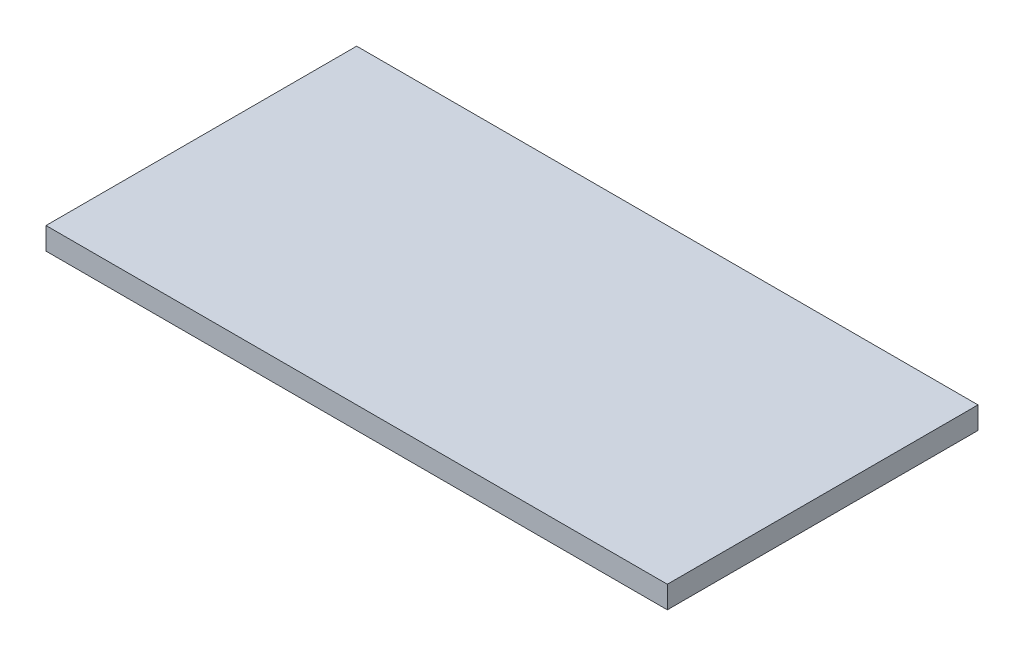
ISO-10303-21;
HEADER;
FILE_DESCRIPTION(('STEP AP214'),'2;1');
FILE_NAME('part.step','',(''),(''),'','','');
FILE_SCHEMA(('AUTOMOTIVE_DESIGN { 1 0 10303 214 1 1 1 1 }'));
ENDSEC;
DATA;
#1=APPLICATION_CONTEXT('core data for automotive mechanical design processes');
#2=APPLICATION_PROTOCOL_DEFINITION('international standard','automotive_design',2000,#1);
#3=PRODUCT_CONTEXT('',#1,'mechanical');
#4=PRODUCT('Part','Part','',(#3));
#5=PRODUCT_RELATED_PRODUCT_CATEGORY('part','',(#4));
#6=PRODUCT_DEFINITION_FORMATION('','',#4);
#7=PRODUCT_DEFINITION_CONTEXT('part definition',#1,'design');
#8=PRODUCT_DEFINITION('design','',#6,#7);
#9=PRODUCT_DEFINITION_SHAPE('','',#8);
#10=(LENGTH_UNIT() NAMED_UNIT(*) SI_UNIT(.MILLI.,.METRE.));
#11=(NAMED_UNIT(*) PLANE_ANGLE_UNIT() SI_UNIT($,.RADIAN.));
#12=(NAMED_UNIT(*) SI_UNIT($,.STERADIAN.) SOLID_ANGLE_UNIT());
#13=UNCERTAINTY_MEASURE_WITH_UNIT(LENGTH_MEASURE(1.E-05),#10,'distance_accuracy_value','');
#14=(GEOMETRIC_REPRESENTATION_CONTEXT(3) GLOBAL_UNCERTAINTY_ASSIGNED_CONTEXT((#13)) GLOBAL_UNIT_ASSIGNED_CONTEXT((#10,
#11,#12)) REPRESENTATION_CONTEXT('',''));
#15=CARTESIAN_POINT('',(0.,0.,0.));
#16=DIRECTION('',(0.,0.,1.));
#17=DIRECTION('',(1.,0.,0.));
#18=AXIS2_PLACEMENT_3D('',#15,#16,#17);
#19=CARTESIAN_POINT('',(0.,3.175,0.));
#20=DIRECTION('',(1.,0.,0.));
#21=DIRECTION('',(0.,0.,-1.));
#22=AXIS2_PLACEMENT_3D('',#19,#20,#21);
#23=PLANE('',#22);
#24=DIRECTION('',(0.,0.,1.));
#25=VECTOR('',#24,1.);
#26=CARTESIAN_POINT('',(0.,0.,0.));
#27=LINE('',#26,#25);
#28=CARTESIAN_POINT('',(0.,0.,0.));
#29=VERTEX_POINT('',#28);
#30=CARTESIAN_POINT('',(0.,0.,44.45));
#31=VERTEX_POINT('',#30);
#32=EDGE_CURVE('E95',#29,#31,#27,.T.);
#33=ORIENTED_EDGE('',*,*,#32,.T.);
#34=DIRECTION('',(0.,-1.,0.));
#35=VECTOR('',#34,1.);
#36=CARTESIAN_POINT('',(0.,3.175,44.45));
#37=LINE('',#36,#35);
#38=CARTESIAN_POINT('',(0.,3.175,44.45));
#39=VERTEX_POINT('',#38);
#40=EDGE_CURVE('E11',#39,#31,#37,.T.);
#41=ORIENTED_EDGE('',*,*,#40,.F.);
#42=DIRECTION('',(0.,0.,1.));
#43=VECTOR('',#42,1.);
#44=CARTESIAN_POINT('',(0.,3.175,0.));
#45=LINE('',#44,#43);
#46=CARTESIAN_POINT('',(0.,3.175,0.));
#47=VERTEX_POINT('',#46);
#48=EDGE_CURVE('E83',#47,#39,#45,.T.);
#49=ORIENTED_EDGE('',*,*,#48,.F.);
#50=DIRECTION('',(0.,-1.,0.));
#51=VECTOR('',#50,1.);
#52=CARTESIAN_POINT('',(0.,3.175,0.));
#53=LINE('',#52,#51);
#54=EDGE_CURVE('E91',#47,#29,#53,.T.);
#55=ORIENTED_EDGE('',*,*,#54,.T.);
#56=EDGE_LOOP('',(#33,#41,#49,#55));
#57=FACE_BOUND('',#56,.T.);
#58=ADVANCED_FACE('F32',(#57),#23,.F.);
#59=CARTESIAN_POINT('',(0.,3.175,44.45));
#60=DIRECTION('',(0.,0.,-1.));
#61=DIRECTION('',(-1.,0.,0.));
#62=AXIS2_PLACEMENT_3D('',#59,#60,#61);
#63=PLANE('',#62);
#64=DIRECTION('',(1.,0.,0.));
#65=VECTOR('',#64,1.);
#66=CARTESIAN_POINT('',(0.,0.,44.45));
#67=LINE('',#66,#65);
#68=CARTESIAN_POINT('',(88.9,0.,44.45));
#69=VERTEX_POINT('',#68);
#70=EDGE_CURVE('E87',#31,#69,#67,.T.);
#71=ORIENTED_EDGE('',*,*,#70,.T.);
#72=DIRECTION('',(0.,-1.,0.));
#73=VECTOR('',#72,1.);
#74=CARTESIAN_POINT('',(88.9,3.175,44.45));
#75=LINE('',#74,#73);
#76=CARTESIAN_POINT('',(88.9,3.175,44.45));
#77=VERTEX_POINT('',#76);
#78=EDGE_CURVE('E40',#77,#69,#75,.T.);
#79=ORIENTED_EDGE('',*,*,#78,.F.);
#80=DIRECTION('',(1.,0.,0.));
#81=VECTOR('',#80,1.);
#82=CARTESIAN_POINT('',(0.,3.175,44.45));
#83=LINE('',#82,#81);
#84=EDGE_CURVE('E78',#39,#77,#83,.T.);
#85=ORIENTED_EDGE('',*,*,#84,.F.);
#86=ORIENTED_EDGE('',*,*,#40,.T.);
#87=EDGE_LOOP('',(#71,#79,#85,#86));
#88=FACE_BOUND('',#87,.T.);
#89=ADVANCED_FACE('F86',(#88),#63,.F.);
#90=CARTESIAN_POINT('',(88.9,3.175,0.));
#91=DIRECTION('',(-1.,0.,0.));
#92=DIRECTION('',(0.,0.,1.));
#93=AXIS2_PLACEMENT_3D('',#90,#91,#92);
#94=PLANE('',#93);
#95=DIRECTION('',(0.,0.,-1.));
#96=VECTOR('',#95,1.);
#97=CARTESIAN_POINT('',(88.9,0.,0.));
#98=LINE('',#97,#96);
#99=CARTESIAN_POINT('',(88.9,0.,0.));
#100=VERTEX_POINT('',#99);
#101=EDGE_CURVE('E65',#69,#100,#98,.T.);
#102=ORIENTED_EDGE('',*,*,#101,.T.);
#103=DIRECTION('',(0.,-1.,0.));
#104=VECTOR('',#103,1.);
#105=CARTESIAN_POINT('',(88.9,3.175,0.));
#106=LINE('',#105,#104);
#107=CARTESIAN_POINT('',(88.9,3.175,0.));
#108=VERTEX_POINT('',#107);
#109=EDGE_CURVE('E88',#108,#100,#106,.T.);
#110=ORIENTED_EDGE('',*,*,#109,.F.);
#111=DIRECTION('',(0.,0.,-1.));
#112=VECTOR('',#111,1.);
#113=CARTESIAN_POINT('',(88.9,3.175,0.));
#114=LINE('',#113,#112);
#115=EDGE_CURVE('E81',#77,#108,#114,.T.);
#116=ORIENTED_EDGE('',*,*,#115,.F.);
#117=ORIENTED_EDGE('',*,*,#78,.T.);
#118=EDGE_LOOP('',(#102,#110,#116,#117));
#119=FACE_BOUND('',#118,.T.);
#120=ADVANCED_FACE('F89',(#119),#94,.F.);
#121=CARTESIAN_POINT('',(0.,3.175,0.));
#122=DIRECTION('',(0.,0.,1.));
#123=DIRECTION('',(1.,0.,0.));
#124=AXIS2_PLACEMENT_3D('',#121,#122,#123);
#125=PLANE('',#124);
#126=DIRECTION('',(-1.,0.,0.));
#127=VECTOR('',#126,1.);
#128=CARTESIAN_POINT('',(0.,0.,0.));
#129=LINE('',#128,#127);
#130=EDGE_CURVE('E71',#100,#29,#129,.T.);
#131=ORIENTED_EDGE('',*,*,#130,.T.);
#132=ORIENTED_EDGE('',*,*,#54,.F.);
#133=DIRECTION('',(-1.,0.,0.));
#134=VECTOR('',#133,1.);
#135=CARTESIAN_POINT('',(0.,3.175,0.));
#136=LINE('',#135,#134);
#137=EDGE_CURVE('E48',#108,#47,#136,.T.);
#138=ORIENTED_EDGE('',*,*,#137,.F.);
#139=ORIENTED_EDGE('',*,*,#109,.T.);
#140=EDGE_LOOP('',(#131,#132,#138,#139));
#141=FACE_BOUND('',#140,.T.);
#142=ADVANCED_FACE('F102',(#141),#125,.F.);
#143=CARTESIAN_POINT('',(0.,3.175,0.));
#144=DIRECTION('',(0.,1.,0.));
#145=DIRECTION('',(0.,0.,1.));
#146=AXIS2_PLACEMENT_3D('',#143,#144,#145);
#147=PLANE('',#146);
#148=ORIENTED_EDGE('',*,*,#48,.T.);
#149=ORIENTED_EDGE('',*,*,#84,.T.);
#150=ORIENTED_EDGE('',*,*,#115,.T.);
#151=ORIENTED_EDGE('',*,*,#137,.T.);
#152=EDGE_LOOP('',(#148,#149,#150,#151));
#153=FACE_BOUND('',#152,.T.);
#154=ADVANCED_FACE('F79',(#153),#147,.T.);
#155=CARTESIAN_POINT('',(0.,0.,0.));
#156=DIRECTION('',(0.,1.,0.));
#157=DIRECTION('',(0.,0.,1.));
#158=AXIS2_PLACEMENT_3D('',#155,#156,#157);
#159=PLANE('',#158);
#160=ORIENTED_EDGE('',*,*,#32,.F.);
#161=ORIENTED_EDGE('',*,*,#130,.F.);
#162=ORIENTED_EDGE('',*,*,#101,.F.);
#163=ORIENTED_EDGE('',*,*,#70,.F.);
#164=EDGE_LOOP('',(#160,#161,#162,#163));
#165=FACE_BOUND('',#164,.T.);
#166=ADVANCED_FACE('F105',(#165),#159,.F.);
#167=CLOSED_SHELL('',(#58,#89,#120,#142,#154,#166));
#168=MANIFOLD_SOLID_BREP('B2',#167);
#169=ADVANCED_BREP_SHAPE_REPRESENTATION('',(#18,#168),#14);
#170=SHAPE_DEFINITION_REPRESENTATION(#9,#169);
ENDSEC;
END-ISO-10303-21;
